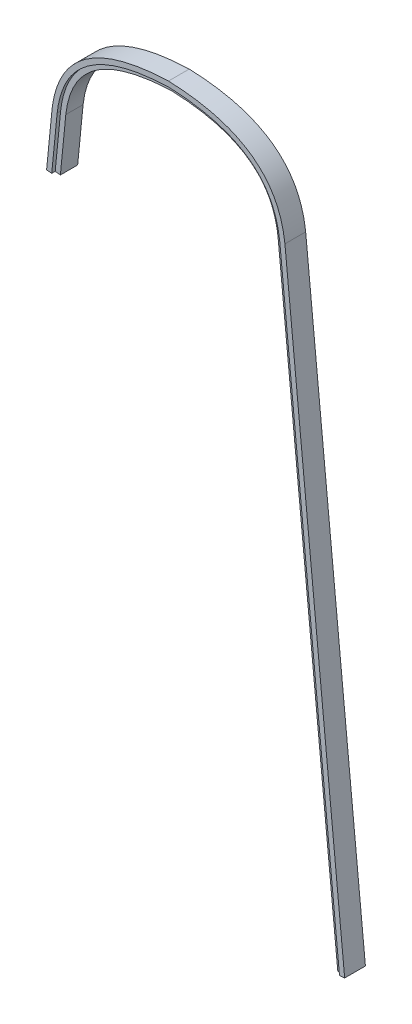
ISO-10303-21;
HEADER;
FILE_DESCRIPTION(('STEP AP214'),'2;1');
FILE_NAME('part.step','',(''),(''),'','','');
FILE_SCHEMA(('AUTOMOTIVE_DESIGN { 1 0 10303 214 1 1 1 1 }'));
ENDSEC;
DATA;
#1=APPLICATION_CONTEXT('core data for automotive mechanical design processes');
#2=APPLICATION_PROTOCOL_DEFINITION('international standard','automotive_design',2000,#1);
#3=PRODUCT_CONTEXT('',#1,'mechanical');
#4=PRODUCT('Part','Part','',(#3));
#5=PRODUCT_RELATED_PRODUCT_CATEGORY('part','',(#4));
#6=PRODUCT_DEFINITION_FORMATION('','',#4);
#7=PRODUCT_DEFINITION_CONTEXT('part definition',#1,'design');
#8=PRODUCT_DEFINITION('design','',#6,#7);
#9=PRODUCT_DEFINITION_SHAPE('','',#8);
#10=(LENGTH_UNIT() NAMED_UNIT(*) SI_UNIT(.MILLI.,.METRE.));
#11=(NAMED_UNIT(*) PLANE_ANGLE_UNIT() SI_UNIT($,.RADIAN.));
#12=(NAMED_UNIT(*) SI_UNIT($,.STERADIAN.) SOLID_ANGLE_UNIT());
#13=UNCERTAINTY_MEASURE_WITH_UNIT(LENGTH_MEASURE(1.E-05),#10,'distance_accuracy_value','');
#14=(GEOMETRIC_REPRESENTATION_CONTEXT(3) GLOBAL_UNCERTAINTY_ASSIGNED_CONTEXT((#13)) GLOBAL_UNIT_ASSIGNED_CONTEXT((#10,
#11,#12)) REPRESENTATION_CONTEXT('',''));
#15=CARTESIAN_POINT('',(0.,0.,0.));
#16=DIRECTION('',(0.,0.,1.));
#17=DIRECTION('',(1.,0.,0.));
#18=AXIS2_PLACEMENT_3D('',#15,#16,#17);
#19=CARTESIAN_POINT('',(-111.860365765845,686.278790089287,19.05));
#20=DIRECTION('',(0.0981158450861748,0.995175000159784,0.));
#21=DIRECTION('',(-0.995175000159784,0.0981158450861748,0.));
#22=AXIS2_PLACEMENT_3D('',#19,#20,#21);
#23=PLANE('',#22);
#24=DIRECTION('',(0.,0.,-1.));
#25=VECTOR('',#24,1.);
#26=CARTESIAN_POINT('',(-107.133483550086,685.812759448297,905.176645887389));
#27=LINE('',#26,#25);
#28=CARTESIAN_POINT('',(-107.133483550086,685.812759448297,19.05));
#29=VERTEX_POINT('',#28);
#30=CARTESIAN_POINT('',(-107.133483550086,685.812759448297,15.875));
#31=VERTEX_POINT('',#30);
#32=EDGE_CURVE('E167',#29,#31,#27,.T.);
#33=ORIENTED_EDGE('',*,*,#32,.F.);
#34=DIRECTION('',(0.995175000159784,-0.0981158450861748,0.));
#35=VECTOR('',#34,1.);
#36=CARTESIAN_POINT('',(-111.860365765845,686.278790089287,19.05));
#37=LINE('',#36,#35);
#38=CARTESIAN_POINT('',(-111.860365765845,686.278790089287,19.05));
#39=VERTEX_POINT('',#38);
#40=EDGE_CURVE('E261',#39,#29,#37,.T.);
#41=ORIENTED_EDGE('',*,*,#40,.F.);
#42=DIRECTION('',(0.,0.,-1.));
#43=VECTOR('',#42,1.);
#44=CARTESIAN_POINT('',(-111.860365765845,686.278790089287,19.05));
#45=LINE('',#44,#43);
#46=CARTESIAN_POINT('',(-111.860365765845,686.278790089287,0.));
#47=VERTEX_POINT('',#46);
#48=EDGE_CURVE('E322',#39,#47,#45,.T.);
#49=ORIENTED_EDGE('',*,*,#48,.T.);
#50=DIRECTION('',(0.995175000159784,-0.0981158450861748,0.));
#51=VECTOR('',#50,1.);
#52=CARTESIAN_POINT('',(-111.860365765845,686.278790089287,0.));
#53=LINE('',#52,#51);
#54=CARTESIAN_POINT('',(-102.381323889323,685.344236664841,0.));
#55=VERTEX_POINT('',#54);
#56=EDGE_CURVE('E277',#47,#55,#53,.T.);
#57=ORIENTED_EDGE('',*,*,#56,.T.);
#58=DIRECTION('',(0.,0.,-1.));
#59=VECTOR('',#58,1.);
#60=CARTESIAN_POINT('',(-102.381323889323,685.344236664841,19.05));
#61=LINE('',#60,#59);
#62=CARTESIAN_POINT('',(-102.381323889323,685.344236664841,15.875));
#63=VERTEX_POINT('',#62);
#64=EDGE_CURVE('E320',#63,#55,#61,.T.);
#65=ORIENTED_EDGE('',*,*,#64,.F.);
#66=DIRECTION('',(0.995175000159784,-0.0981158450861748,0.));
#67=VECTOR('',#66,1.);
#68=CARTESIAN_POINT('',(-111.860365765845,686.278790089287,15.875));
#69=LINE('',#68,#67);
#70=EDGE_CURVE('E49',#31,#63,#69,.T.);
#71=ORIENTED_EDGE('',*,*,#70,.F.);
#72=EDGE_LOOP('',(#33,#41,#49,#57,#65,#71));
#73=FACE_BOUND('',#72,.T.);
#74=ADVANCED_FACE('F33',(#73),#23,.F.);
#75=CARTESIAN_POINT('',(152.224173193232,179.795336583684,19.05));
#76=DIRECTION('',(-0.0981158450864142,0.99517500015976,0.));
#77=DIRECTION('',(-0.99517500015976,-0.0981158450864142,0.));
#78=AXIS2_PLACEMENT_3D('',#75,#76,#77);
#79=PLANE('',#78);
#80=DIRECTION('',(0.,0.,-1.));
#81=VECTOR('',#80,1.);
#82=CARTESIAN_POINT('',(156.976332853995,180.263859367141,905.176645887389));
#83=LINE('',#82,#81);
#84=CARTESIAN_POINT('',(156.976332853995,180.263859367141,19.05));
#85=VERTEX_POINT('',#84);
#86=CARTESIAN_POINT('',(156.976332853995,180.263859367141,15.875));
#87=VERTEX_POINT('',#86);
#88=EDGE_CURVE('E159',#85,#87,#83,.T.);
#89=ORIENTED_EDGE('',*,*,#88,.T.);
#90=DIRECTION('',(0.99517500015976,0.0981158450864142,0.));
#91=VECTOR('',#90,1.);
#92=CARTESIAN_POINT('',(152.224173193232,179.795336583684,15.875));
#93=LINE('',#92,#91);
#94=CARTESIAN_POINT('',(152.224173193232,179.795336583684,15.875));
#95=VERTEX_POINT('',#94);
#96=EDGE_CURVE('E384',#95,#87,#93,.T.);
#97=ORIENTED_EDGE('',*,*,#96,.F.);
#98=DIRECTION('',(0.,0.,-1.));
#99=VECTOR('',#98,1.);
#100=CARTESIAN_POINT('',(152.224173193232,179.795336583684,19.05));
#101=LINE('',#100,#99);
#102=CARTESIAN_POINT('',(152.224173193232,179.795336583684,0.));
#103=VERTEX_POINT('',#102);
#104=EDGE_CURVE('E312',#95,#103,#101,.T.);
#105=ORIENTED_EDGE('',*,*,#104,.T.);
#106=DIRECTION('',(0.99517500015976,0.0981158450864142,0.));
#107=VECTOR('',#106,1.);
#108=CARTESIAN_POINT('',(152.224173193232,179.795336583684,0.));
#109=LINE('',#108,#107);
#110=CARTESIAN_POINT('',(161.703215069754,180.729890008132,0.));
#111=VERTEX_POINT('',#110);
#112=EDGE_CURVE('E302',#103,#111,#109,.T.);
#113=ORIENTED_EDGE('',*,*,#112,.T.);
#114=DIRECTION('',(0.,0.,-1.));
#115=VECTOR('',#114,1.);
#116=CARTESIAN_POINT('',(161.703215069754,180.729890008132,19.05));
#117=LINE('',#116,#115);
#118=CARTESIAN_POINT('',(161.703215069754,180.729890008132,19.05));
#119=VERTEX_POINT('',#118);
#120=EDGE_CURVE('E309',#119,#111,#117,.T.);
#121=ORIENTED_EDGE('',*,*,#120,.F.);
#122=DIRECTION('',(0.99517500015976,0.0981158450864142,0.));
#123=VECTOR('',#122,1.);
#124=CARTESIAN_POINT('',(152.224173193232,179.795336583684,19.05));
#125=LINE('',#124,#123);
#126=EDGE_CURVE('E255',#85,#119,#125,.T.);
#127=ORIENTED_EDGE('',*,*,#126,.F.);
#128=EDGE_LOOP('',(#89,#97,#105,#113,#121,#127));
#129=FACE_BOUND('',#128,.T.);
#130=ADVANCED_FACE('F224',(#129),#79,.F.);
#131=CARTESIAN_POINT('',(76.0468024928911,792.100975721355,19.05));
#132=DIRECTION('',(0.,0.,-1.));
#133=DIRECTION('',(-1.,0.,0.));
#134=AXIS2_PLACEMENT_3D('',#131,#132,#133);
#135=PLANE('',#134);
#136=DIRECTION('',(0.0981158450862154,0.99517500015978,0.));
#137=VECTOR('',#136,1.);
#138=CARTESIAN_POINT('',(-102.152626970838,736.332876180646,19.05));
#139=LINE('',#138,#137);
#140=CARTESIAN_POINT('',(-102.152626970859,736.332876180622,19.05));
#141=VERTEX_POINT('',#140);
#142=EDGE_CURVE('E385',#29,#141,#139,.T.);
#143=ORIENTED_EDGE('',*,*,#142,.T.);
#144=CARTESIAN_POINT('',(2.10980796093267E-09,808.047304319422,19.05));
#145=CARTESIAN_POINT('',(-16.1223221690936,807.479219325401,19.05));
#146=CARTESIAN_POINT('',(-30.2987976291191,805.498551699414,19.05));
#147=CARTESIAN_POINT('',(-48.6193709172104,800.498919802227,19.05));
#148=CARTESIAN_POINT('',(-54.2358300324914,798.495292835486,19.05));
#149=CARTESIAN_POINT('',(-64.4994761364401,793.836180237799,19.05));
#150=CARTESIAN_POINT('',(-69.1465290738747,791.181342383898,19.05));
#151=CARTESIAN_POINT('',(-77.5040816009162,785.234589870984,19.05));
#152=CARTESIAN_POINT('',(-81.2153211256746,781.943258676947,19.05));
#153=CARTESIAN_POINT('',(-87.7489953169181,774.708742888267,19.05));
#154=CARTESIAN_POINT('',(-90.5725371252872,770.764926128253,19.05));
#155=CARTESIAN_POINT('',(-95.36185423474,762.178148206602,19.05));
#156=CARTESIAN_POINT('',(-97.3275552657608,757.533990297598,19.05));
#157=CARTESIAN_POINT('',(-100.395212832108,747.499058108064,19.05));
#158=CARTESIAN_POINT('',(-101.496352880589,742.108028155802,19.05));
#159=CARTESIAN_POINT('',(-102.152626970859,736.332876180622,19.05));
#160=B_SPLINE_CURVE_WITH_KNOTS('',3,(#144,#145,#146,#147,#148,#149,#150,#151,#152,#153,#154,
#155,#156,#157,#158,#159),.UNSPECIFIED.,.F.,.F.,(4,2,2,2,2,2,2,4),(0.,0.25,0.375,0.5,0.625,0.75,
0.875,1.),.UNSPECIFIED.);
#161=CARTESIAN_POINT('',(2.10193356318424E-09,808.047304319427,19.05));
#162=VERTEX_POINT('',#161);
#163=EDGE_CURVE('E147',#141,#162,#160,.F.);
#164=ORIENTED_EDGE('',*,*,#163,.T.);
#165=CARTESIAN_POINT('',(102.152626970824,736.332876180851,19.05));
#166=CARTESIAN_POINT('',(101.496352880563,742.108028155893,19.05));
#167=CARTESIAN_POINT('',(100.395212832143,747.499058108064,19.05));
#168=CARTESIAN_POINT('',(97.3275552658921,757.53399029739,19.05));
#169=CARTESIAN_POINT('',(95.3618542349437,762.178148206308,19.05));
#170=CARTESIAN_POINT('',(90.5725371256659,770.764926127815,19.05));
#171=CARTESIAN_POINT('',(87.7489953173806,774.708742887744,19.05));
#172=CARTESIAN_POINT('',(81.2153211263951,781.943258676337,19.05));
#173=CARTESIAN_POINT('',(77.5040816017928,785.234589870374,19.05));
#174=CARTESIAN_POINT('',(69.1465290751,791.181342383259,19.05));
#175=CARTESIAN_POINT('',(64.4994761378949,793.836180237189,19.05));
#176=CARTESIAN_POINT('',(54.2358300343883,798.495292834908,19.05));
#177=CARTESIAN_POINT('',(48.6193709193301,800.498919801625,19.05));
#178=CARTESIAN_POINT('',(30.2987976320406,805.49855169896,19.05));
#179=CARTESIAN_POINT('',(16.1223221725936,807.479219325171,19.05));
#180=CARTESIAN_POINT('',(2.10193356318424E-09,808.047304319427,19.05));
#181=B_SPLINE_CURVE_WITH_KNOTS('',3,(#165,#166,#167,#168,#169,#170,#171,#172,#173,#174,#175,
#176,#177,#178,#179,#180),.UNSPECIFIED.,.F.,.F.,(4,2,2,2,2,2,2,4),(0.,0.125,0.25,0.375,0.5,
0.625,0.75,1.),.UNSPECIFIED.);
#182=CARTESIAN_POINT('',(102.152626970806,736.332876180879,19.0500000000002));
#183=VERTEX_POINT('',#182);
#184=EDGE_CURVE('E141',#162,#183,#181,.F.);
#185=ORIENTED_EDGE('',*,*,#184,.T.);
#186=DIRECTION('',(0.0981158450864326,-0.995175000159759,0.));
#187=VECTOR('',#186,1.);
#188=CARTESIAN_POINT('',(156.976332853995,180.263859367141,19.05));
#189=LINE('',#188,#187);
#190=EDGE_CURVE('E144',#183,#85,#189,.T.);
#191=ORIENTED_EDGE('',*,*,#190,.T.);
#192=ORIENTED_EDGE('',*,*,#126,.T.);
#193=DIRECTION('',(-0.0981158450864121,0.99517500015976,0.));
#194=VECTOR('',#193,1.);
#195=CARTESIAN_POINT('',(161.703215069754,180.729890008132,19.05));
#196=LINE('',#195,#194);
#197=CARTESIAN_POINT('',(106.876080835467,736.833680097404,19.05));
#198=VERTEX_POINT('',#197);
#199=EDGE_CURVE('E260',#119,#198,#196,.T.);
#200=ORIENTED_EDGE('',*,*,#199,.T.);
#201=CARTESIAN_POINT('',(106.876080835467,736.833680097404,19.05));
#202=CARTESIAN_POINT('',(98.6555645680486,809.385111394009,19.05));
#203=CARTESIAN_POINT('',(0.,812.8,19.05));
#204=B_SPLINE_CURVE_WITH_KNOTS('',2,(#201,#202,#203),.UNSPECIFIED.,.F.,.F.,(3,3),(0.,1.),.UNSPECIFIED.);
#205=CARTESIAN_POINT('',(0.,812.8,19.05));
#206=VERTEX_POINT('',#205);
#207=EDGE_CURVE('E306',#198,#206,#204,.T.);
#208=ORIENTED_EDGE('',*,*,#207,.T.);
#209=CARTESIAN_POINT('',(0.,812.8,19.05));
#210=CARTESIAN_POINT('',(-98.6555645680486,809.385111394009,19.05));
#211=CARTESIAN_POINT('',(-106.876080835467,736.833680097404,19.05));
#212=B_SPLINE_CURVE_WITH_KNOTS('',2,(#209,#210,#211),.UNSPECIFIED.,.F.,.F.,(3,3),(0.,1.),.UNSPECIFIED.);
#213=CARTESIAN_POINT('',(-106.876080835467,736.833680097404,19.05));
#214=VERTEX_POINT('',#213);
#215=EDGE_CURVE('E339',#206,#214,#212,.T.);
#216=ORIENTED_EDGE('',*,*,#215,.T.);
#217=DIRECTION('',(-0.0981158450861761,-0.995175000159784,0.));
#218=VECTOR('',#217,1.);
#219=CARTESIAN_POINT('',(-111.860365765845,686.278790089287,19.05));
#220=LINE('',#219,#218);
#221=EDGE_CURVE('E331',#214,#39,#220,.T.);
#222=ORIENTED_EDGE('',*,*,#221,.T.);
#223=ORIENTED_EDGE('',*,*,#40,.T.);
#224=EDGE_LOOP('',(#143,#164,#185,#191,#192,#200,#208,#216,#222,#223));
#225=FACE_BOUND('',#224,.T.);
#226=ADVANCED_FACE('F143',(#225),#135,.F.);
#227=DIRECTION('',(0.,0.,-1.));
#228=VECTOR('',#227,1.);
#229=SURFACE_OF_LINEAR_EXTRUSION('',#204,#228);
#230=CARTESIAN_POINT('',(106.876080835467,736.833680097404,0.));
#231=CARTESIAN_POINT('',(98.6555645680486,809.385111394009,0.));
#232=CARTESIAN_POINT('',(0.,812.8,0.));
#233=B_SPLINE_CURVE_WITH_KNOTS('',2,(#230,#231,#232),.UNSPECIFIED.,.F.,.F.,(3,3),(0.,1.),.UNSPECIFIED.);
#234=CARTESIAN_POINT('',(106.876080835467,736.833680097404,0.));
#235=VERTEX_POINT('',#234);
#236=CARTESIAN_POINT('',(0.,812.8,0.));
#237=VERTEX_POINT('',#236);
#238=EDGE_CURVE('E189',#235,#237,#233,.T.);
#239=ORIENTED_EDGE('',*,*,#238,.T.);
#240=DIRECTION('',(0.,0.,-1.));
#241=VECTOR('',#240,1.);
#242=CARTESIAN_POINT('',(0.,812.8,19.05));
#243=LINE('',#242,#241);
#244=EDGE_CURVE('E11',#206,#237,#243,.T.);
#245=ORIENTED_EDGE('',*,*,#244,.F.);
#246=ORIENTED_EDGE('',*,*,#207,.F.);
#247=DIRECTION('',(0.,0.,-1.));
#248=VECTOR('',#247,1.);
#249=CARTESIAN_POINT('',(106.876080835467,736.833680097404,19.05));
#250=LINE('',#249,#248);
#251=EDGE_CURVE('E262',#198,#235,#250,.T.);
#252=ORIENTED_EDGE('',*,*,#251,.T.);
#253=EDGE_LOOP('',(#239,#245,#246,#252));
#254=FACE_BOUND('',#253,.T.);
#255=ADVANCED_FACE('F35',(#254),#229,.F.);
#256=DIRECTION('',(0.,0.,-1.));
#257=VECTOR('',#256,1.);
#258=SURFACE_OF_LINEAR_EXTRUSION('',#212,#257);
#259=CARTESIAN_POINT('',(0.,812.8,0.));
#260=CARTESIAN_POINT('',(-98.6555645680486,809.385111394009,0.));
#261=CARTESIAN_POINT('',(-106.876080835467,736.833680097404,0.));
#262=B_SPLINE_CURVE_WITH_KNOTS('',2,(#259,#260,#261),.UNSPECIFIED.,.F.,.F.,(3,3),(0.,1.),.UNSPECIFIED.);
#263=CARTESIAN_POINT('',(-106.876080835467,736.833680097404,0.));
#264=VERTEX_POINT('',#263);
#265=EDGE_CURVE('E194',#237,#264,#262,.T.);
#266=ORIENTED_EDGE('',*,*,#265,.T.);
#267=DIRECTION('',(0.,0.,-1.));
#268=VECTOR('',#267,1.);
#269=CARTESIAN_POINT('',(-106.876080835467,736.833680097404,19.05));
#270=LINE('',#269,#268);
#271=EDGE_CURVE('E42',#214,#264,#270,.T.);
#272=ORIENTED_EDGE('',*,*,#271,.F.);
#273=ORIENTED_EDGE('',*,*,#215,.F.);
#274=ORIENTED_EDGE('',*,*,#244,.T.);
#275=EDGE_LOOP('',(#266,#272,#273,#274));
#276=FACE_BOUND('',#275,.T.);
#277=ADVANCED_FACE('F352',(#276),#258,.F.);
#278=CARTESIAN_POINT('',(-111.860365765845,686.278790089287,19.05));
#279=DIRECTION('',(0.995175000159784,-0.0981158450861761,0.));
#280=DIRECTION('',(0.0981158450861761,0.995175000159784,0.));
#281=AXIS2_PLACEMENT_3D('',#278,#279,#280);
#282=PLANE('',#281);
#283=DIRECTION('',(-0.0981158450861761,-0.995175000159784,0.));
#284=VECTOR('',#283,1.);
#285=CARTESIAN_POINT('',(-111.860365765845,686.278790089287,0.));
#286=LINE('',#285,#284);
#287=EDGE_CURVE('E272',#264,#47,#286,.T.);
#288=ORIENTED_EDGE('',*,*,#287,.T.);
#289=ORIENTED_EDGE('',*,*,#48,.F.);
#290=ORIENTED_EDGE('',*,*,#221,.F.);
#291=ORIENTED_EDGE('',*,*,#271,.T.);
#292=EDGE_LOOP('',(#288,#289,#290,#291));
#293=FACE_BOUND('',#292,.T.);
#294=ADVANCED_FACE('F329',(#293),#282,.F.);
#295=CARTESIAN_POINT('',(-102.381323889323,685.344236664841,19.05));
#296=DIRECTION('',(-0.995175000159784,0.0981158450861753,0.));
#297=DIRECTION('',(-0.0981158450861753,-0.995175000159784,0.));
#298=AXIS2_PLACEMENT_3D('',#295,#296,#297);
#299=PLANE('',#298);
#300=DIRECTION('',(0.,0.,-1.));
#301=VECTOR('',#300,1.);
#302=CARTESIAN_POINT('',(-97.4039935722563,735.828587023661,19.05));
#303=LINE('',#302,#301);
#304=CARTESIAN_POINT('',(-97.4039935722563,735.828587023661,15.875));
#305=VERTEX_POINT('',#304);
#306=CARTESIAN_POINT('',(-97.4039935722563,735.828587023661,0.));
#307=VERTEX_POINT('',#306);
#308=EDGE_CURVE('E318',#305,#307,#303,.T.);
#309=ORIENTED_EDGE('',*,*,#308,.F.);
#310=DIRECTION('',(0.0981158450861753,0.995175000159784,0.));
#311=VECTOR('',#310,1.);
#312=CARTESIAN_POINT('',(-102.381323889323,685.344236664841,15.875));
#313=LINE('',#312,#311);
#314=EDGE_CURVE('E57',#63,#305,#313,.T.);
#315=ORIENTED_EDGE('',*,*,#314,.F.);
#316=ORIENTED_EDGE('',*,*,#64,.T.);
#317=DIRECTION('',(0.0981158450861753,0.995175000159784,0.));
#318=VECTOR('',#317,1.);
#319=CARTESIAN_POINT('',(-102.381323889323,685.344236664841,0.));
#320=LINE('',#319,#318);
#321=EDGE_CURVE('E280',#55,#307,#320,.T.);
#322=ORIENTED_EDGE('',*,*,#321,.T.);
#323=EDGE_LOOP('',(#309,#315,#316,#322));
#324=FACE_BOUND('',#323,.T.);
#325=ADVANCED_FACE('F357',(#324),#299,.F.);
#326=CARTESIAN_POINT('',(-97.4039935722563,735.828587023661,19.05));
#327=CARTESIAN_POINT('',(-97.326205951253,736.510966359989,19.05));
#328=CARTESIAN_POINT('',(-97.155379667203,737.881968464563,19.05));
#329=CARTESIAN_POINT('',(-96.7640206157551,740.553537606214,19.05));
#330=CARTESIAN_POINT('',(-96.1773627381843,743.805316844232,19.05));
#331=CARTESIAN_POINT('',(-95.3214140006335,747.554999290884,19.05));
#332=CARTESIAN_POINT('',(-93.979934001174,752.35928640652,19.05));
#333=CARTESIAN_POINT('',(-91.9331304846639,758.003164249531,19.05));
#334=CARTESIAN_POINT('',(-88.8952522600488,764.228265264045,19.05));
#335=CARTESIAN_POINT('',(-85.2743135617032,769.94319981308,19.05));
#336=CARTESIAN_POINT('',(-79.6482414168445,776.932392043285,19.05));
#337=CARTESIAN_POINT('',(-71.0507907120023,784.572420077555,19.05));
#338=CARTESIAN_POINT('',(-60.1294569627952,790.832450745801,19.05));
#339=CARTESIAN_POINT('',(-49.8978420395021,794.967332344282,19.05));
#340=CARTESIAN_POINT('',(-41.4669949701455,797.61410959326,19.05));
#341=CARTESIAN_POINT('',(-32.2731280075788,799.790052384111,19.05));
#342=CARTESIAN_POINT('',(-23.9757920629625,801.198424890801,19.05));
#343=CARTESIAN_POINT('',(-16.9573043317651,802.075979485788,19.05));
#344=CARTESIAN_POINT('',(-11.5049121120337,802.608232021653,19.05));
#345=CARTESIAN_POINT('',(-6.80036284859541,802.946009067599,19.05));
#346=CARTESIAN_POINT('',(-2.95007512349241,803.15190905775,19.05));
#347=CARTESIAN_POINT('',(-0.979817657945961,803.233925105122,19.05));
#348=CARTESIAN_POINT('',(4.83499958819911E-13,803.269086279872,19.05));
#349=B_SPLINE_CURVE_WITH_KNOTS('',3,(#326,#327,#328,#329,#330,#331,#332,#333,#334,#335,#336,
#337,#338,#339,#340,#341,#342,#343,#344,#345,#346,#347,#348),.UNSPECIFIED.,.F.,.F.,(4,1,1,1,1,1,
1,1,1,1,1,1,1,1,1,1,1,1,1,1,4),(0.000508173003004952,0.0160981610015977,0.0316881490001905,
0.062868124997376,0.0940481009945616,0.125228076991747,0.187588028986118,0.249947980980489,
0.31230793297486,0.374667884969231,0.499387788957974,0.624107692946716,0.686467644941087,
0.748827596935458,0.811187548929829,0.8735475009242,0.904727476921386,0.935907452918571,
0.967087428915757,0.98267741691435,0.998267404912942),.UNSPECIFIED.);
#350=DIRECTION('',(0.,0.,-1.));
#351=VECTOR('',#350,1.);
#352=SURFACE_OF_LINEAR_EXTRUSION('',#349,#351);
#353=DIRECTION('',(0.,0.,-1.));
#354=VECTOR('',#353,1.);
#355=CARTESIAN_POINT('',(4.83499958819911E-13,803.269086279872,19.05));
#356=LINE('',#355,#354);
#357=CARTESIAN_POINT('',(4.83499958819911E-13,803.269086279872,15.875));
#358=VERTEX_POINT('',#357);
#359=CARTESIAN_POINT('',(4.83499958819911E-13,803.269086279872,0.));
#360=VERTEX_POINT('',#359);
#361=EDGE_CURVE('E316',#358,#360,#356,.T.);
#362=ORIENTED_EDGE('',*,*,#361,.F.);
#363=CARTESIAN_POINT('',(-97.4039935722563,735.828587023661,15.875));
#364=CARTESIAN_POINT('',(-97.326205951253,736.510966359989,15.875));
#365=CARTESIAN_POINT('',(-97.155379667203,737.881968464563,15.875));
#366=CARTESIAN_POINT('',(-96.7640206157551,740.553537606214,15.875));
#367=CARTESIAN_POINT('',(-96.1773627381843,743.805316844232,15.875));
#368=CARTESIAN_POINT('',(-95.3214140006335,747.554999290884,15.875));
#369=CARTESIAN_POINT('',(-93.979934001174,752.35928640652,15.875));
#370=CARTESIAN_POINT('',(-91.9331304846639,758.003164249531,15.875));
#371=CARTESIAN_POINT('',(-88.8952522600488,764.228265264045,15.875));
#372=CARTESIAN_POINT('',(-85.2743135617032,769.94319981308,15.875));
#373=CARTESIAN_POINT('',(-79.6482414168445,776.932392043285,15.875));
#374=CARTESIAN_POINT('',(-71.0507907120023,784.572420077555,15.875));
#375=CARTESIAN_POINT('',(-60.1294569627952,790.832450745801,15.875));
#376=CARTESIAN_POINT('',(-49.8978420395021,794.967332344282,15.875));
#377=CARTESIAN_POINT('',(-41.4669949701455,797.61410959326,15.875));
#378=CARTESIAN_POINT('',(-32.2731280075788,799.790052384111,15.875));
#379=CARTESIAN_POINT('',(-23.9757920629625,801.198424890801,15.875));
#380=CARTESIAN_POINT('',(-16.9573043317651,802.075979485788,15.875));
#381=CARTESIAN_POINT('',(-11.5049121120337,802.608232021653,15.875));
#382=CARTESIAN_POINT('',(-6.80036284859541,802.946009067599,15.875));
#383=CARTESIAN_POINT('',(-2.95007512349241,803.15190905775,15.875));
#384=CARTESIAN_POINT('',(-0.979817657945961,803.233925105122,15.875));
#385=CARTESIAN_POINT('',(4.83499958819911E-13,803.269086279872,15.875));
#386=B_SPLINE_CURVE_WITH_KNOTS('',3,(#363,#364,#365,#366,#367,#368,#369,#370,#371,#372,#373,
#374,#375,#376,#377,#378,#379,#380,#381,#382,#383,#384,#385),.UNSPECIFIED.,.F.,.F.,(4,1,1,1,1,1,
1,1,1,1,1,1,1,1,1,1,1,1,1,1,4),(0.000508173003004952,0.0160981610015977,0.0316881490001905,
0.062868124997376,0.0940481009945616,0.125228076991747,0.187588028986118,0.249947980980489,
0.31230793297486,0.374667884969231,0.499387788957974,0.624107692946716,0.686467644941087,
0.748827596935458,0.811187548929829,0.8735475009242,0.904727476921386,0.935907452918571,
0.967087428915757,0.98267741691435,0.998267404912942),.UNSPECIFIED.);
#387=EDGE_CURVE('E367',#305,#358,#386,.T.);
#388=ORIENTED_EDGE('',*,*,#387,.F.);
#389=ORIENTED_EDGE('',*,*,#308,.T.);
#390=CARTESIAN_POINT('',(-97.4039935722563,735.828587023661,0.));
#391=CARTESIAN_POINT('',(-97.326205951253,736.510966359989,0.));
#392=CARTESIAN_POINT('',(-97.155379667203,737.881968464563,0.));
#393=CARTESIAN_POINT('',(-96.7640206157551,740.553537606214,0.));
#394=CARTESIAN_POINT('',(-96.1773627381843,743.805316844232,0.));
#395=CARTESIAN_POINT('',(-95.3214140006335,747.554999290884,0.));
#396=CARTESIAN_POINT('',(-93.979934001174,752.35928640652,0.));
#397=CARTESIAN_POINT('',(-91.9331304846639,758.003164249531,0.));
#398=CARTESIAN_POINT('',(-88.8952522600488,764.228265264045,0.));
#399=CARTESIAN_POINT('',(-85.2743135617032,769.94319981308,0.));
#400=CARTESIAN_POINT('',(-79.6482414168445,776.932392043285,0.));
#401=CARTESIAN_POINT('',(-71.0507907120023,784.572420077555,0.));
#402=CARTESIAN_POINT('',(-60.1294569627952,790.832450745801,0.));
#403=CARTESIAN_POINT('',(-49.8978420395021,794.967332344282,0.));
#404=CARTESIAN_POINT('',(-41.4669949701455,797.61410959326,0.));
#405=CARTESIAN_POINT('',(-32.2731280075788,799.790052384111,0.));
#406=CARTESIAN_POINT('',(-23.9757920629625,801.198424890801,0.));
#407=CARTESIAN_POINT('',(-16.9573043317651,802.075979485788,0.));
#408=CARTESIAN_POINT('',(-11.5049121120337,802.608232021653,0.));
#409=CARTESIAN_POINT('',(-6.80036284859541,802.946009067599,0.));
#410=CARTESIAN_POINT('',(-2.95007512349241,803.15190905775,0.));
#411=CARTESIAN_POINT('',(-0.979817657945961,803.233925105122,0.));
#412=CARTESIAN_POINT('',(4.83499958819911E-13,803.269086279872,0.));
#413=B_SPLINE_CURVE_WITH_KNOTS('',3,(#390,#391,#392,#393,#394,#395,#396,#397,#398,#399,#400,
#401,#402,#403,#404,#405,#406,#407,#408,#409,#410,#411,#412),.UNSPECIFIED.,.F.,.F.,(4,1,1,1,1,1,
1,1,1,1,1,1,1,1,1,1,1,1,1,1,4),(0.000508173003004952,0.0160981610015977,0.0316881490001905,
0.062868124997376,0.0940481009945616,0.125228076991747,0.187588028986118,0.249947980980489,
0.31230793297486,0.374667884969231,0.499387788957974,0.624107692946716,0.686467644941087,
0.748827596935458,0.811187548929829,0.8735475009242,0.904727476921386,0.935907452918571,
0.967087428915757,0.98267741691435,0.998267404912942),.UNSPECIFIED.);
#414=EDGE_CURVE('E283',#307,#360,#413,.T.);
#415=ORIENTED_EDGE('',*,*,#414,.T.);
#416=EDGE_LOOP('',(#362,#388,#389,#415));
#417=FACE_BOUND('',#416,.T.);
#418=ADVANCED_FACE('F243',(#417),#352,.F.);
#419=CARTESIAN_POINT('',(-4.7309161796405E-13,803.269086279872,19.05));
#420=CARTESIAN_POINT('',(0.979817657945981,803.233925105122,19.05));
#421=CARTESIAN_POINT('',(2.95007512349245,803.151909057751,19.05));
#422=CARTESIAN_POINT('',(6.80036284859554,802.946009067598,19.05));
#423=CARTESIAN_POINT('',(11.5049121120339,802.608232021652,19.05));
#424=CARTESIAN_POINT('',(16.9573043317653,802.075979485789,19.05));
#425=CARTESIAN_POINT('',(23.9757920629628,801.1984248908,19.05));
#426=CARTESIAN_POINT('',(32.2731280075792,799.79005238411,19.05));
#427=CARTESIAN_POINT('',(41.466994970146,797.61410959326,19.05));
#428=CARTESIAN_POINT('',(49.8978420395027,794.967332344282,19.05));
#429=CARTESIAN_POINT('',(60.1294569627958,790.8324507458,19.05));
#430=CARTESIAN_POINT('',(71.0507907120028,784.572420077556,19.05));
#431=CARTESIAN_POINT('',(79.6482414168451,776.932392043284,19.05));
#432=CARTESIAN_POINT('',(85.2743135617038,769.943199813079,19.05));
#433=CARTESIAN_POINT('',(88.8952522600493,764.228265264044,19.05));
#434=CARTESIAN_POINT('',(91.9331304846643,758.00316424953,19.05));
#435=CARTESIAN_POINT('',(93.9799340011744,752.359286406519,19.05));
#436=CARTESIAN_POINT('',(95.3214140006338,747.554999290883,19.05));
#437=CARTESIAN_POINT('',(96.1773627381847,743.805316844231,19.05));
#438=CARTESIAN_POINT('',(96.7640206157553,740.553537606213,19.05));
#439=CARTESIAN_POINT('',(97.1553796672032,737.881968464562,19.05));
#440=CARTESIAN_POINT('',(97.3262059512532,736.510966359987,19.05));
#441=CARTESIAN_POINT('',(97.4039935722564,735.82858702366,19.05));
#442=B_SPLINE_CURVE_WITH_KNOTS('',3,(#419,#420,#421,#422,#423,#424,#425,#426,#427,#428,#429,
#430,#431,#432,#433,#434,#435,#436,#437,#438,#439,#440,#441),.UNSPECIFIED.,.F.,.F.,(4,1,1,1,1,1,
1,1,1,1,1,1,1,1,1,1,1,1,1,1,4),(0.000508173002992107,0.016098161001585,0.031688149000178,
0.062868124997364,0.09404810099455,0.125228076991736,0.187588028986108,0.24994798098048,
0.312307932974852,0.374667884969223,0.499387788957967,0.624107692946711,0.686467644941083,
0.748827596935455,0.811187548929827,0.873547500924198,0.904727476921384,0.93590745291857,
0.967087428915756,0.982677416914349,0.998267404912942),.UNSPECIFIED.);
#443=DIRECTION('',(0.,0.,-1.));
#444=VECTOR('',#443,1.);
#445=SURFACE_OF_LINEAR_EXTRUSION('',#442,#444);
#446=DIRECTION('',(0.,0.,-1.));
#447=VECTOR('',#446,1.);
#448=CARTESIAN_POINT('',(97.4039935722564,735.82858702366,19.05));
#449=LINE('',#448,#447);
#450=CARTESIAN_POINT('',(97.4039935722564,735.82858702366,15.875));
#451=VERTEX_POINT('',#450);
#452=CARTESIAN_POINT('',(97.4039935722564,735.82858702366,0.));
#453=VERTEX_POINT('',#452);
#454=EDGE_CURVE('E314',#451,#453,#449,.T.);
#455=ORIENTED_EDGE('',*,*,#454,.F.);
#456=CARTESIAN_POINT('',(-4.7309161796405E-13,803.269086279872,15.875));
#457=CARTESIAN_POINT('',(0.979817657945981,803.233925105122,15.875));
#458=CARTESIAN_POINT('',(2.95007512349245,803.151909057751,15.875));
#459=CARTESIAN_POINT('',(6.80036284859554,802.946009067598,15.875));
#460=CARTESIAN_POINT('',(11.5049121120339,802.608232021652,15.875));
#461=CARTESIAN_POINT('',(16.9573043317653,802.075979485789,15.875));
#462=CARTESIAN_POINT('',(23.9757920629628,801.1984248908,15.875));
#463=CARTESIAN_POINT('',(32.2731280075792,799.79005238411,15.875));
#464=CARTESIAN_POINT('',(41.466994970146,797.61410959326,15.875));
#465=CARTESIAN_POINT('',(49.8978420395027,794.967332344282,15.875));
#466=CARTESIAN_POINT('',(60.1294569627958,790.8324507458,15.875));
#467=CARTESIAN_POINT('',(71.0507907120028,784.572420077556,15.875));
#468=CARTESIAN_POINT('',(79.6482414168451,776.932392043284,15.875));
#469=CARTESIAN_POINT('',(85.2743135617038,769.943199813079,15.875));
#470=CARTESIAN_POINT('',(88.8952522600493,764.228265264044,15.875));
#471=CARTESIAN_POINT('',(91.9331304846643,758.00316424953,15.875));
#472=CARTESIAN_POINT('',(93.9799340011744,752.359286406519,15.875));
#473=CARTESIAN_POINT('',(95.3214140006338,747.554999290883,15.875));
#474=CARTESIAN_POINT('',(96.1773627381847,743.805316844231,15.875));
#475=CARTESIAN_POINT('',(96.7640206157553,740.553537606213,15.875));
#476=CARTESIAN_POINT('',(97.1553796672032,737.881968464562,15.875));
#477=CARTESIAN_POINT('',(97.3262059512532,736.510966359987,15.875));
#478=CARTESIAN_POINT('',(97.4039935722564,735.82858702366,15.875));
#479=B_SPLINE_CURVE_WITH_KNOTS('',3,(#456,#457,#458,#459,#460,#461,#462,#463,#464,#465,#466,
#467,#468,#469,#470,#471,#472,#473,#474,#475,#476,#477,#478),.UNSPECIFIED.,.F.,.F.,(4,1,1,1,1,1,
1,1,1,1,1,1,1,1,1,1,1,1,1,1,4),(0.000508173002992107,0.016098161001585,0.031688149000178,
0.062868124997364,0.09404810099455,0.125228076991736,0.187588028986108,0.24994798098048,
0.312307932974852,0.374667884969223,0.499387788957967,0.624107692946711,0.686467644941083,
0.748827596935455,0.811187548929827,0.873547500924198,0.904727476921384,0.93590745291857,
0.967087428915756,0.982677416914349,0.998267404912942),.UNSPECIFIED.);
#480=EDGE_CURVE('E368',#358,#451,#479,.T.);
#481=ORIENTED_EDGE('',*,*,#480,.F.);
#482=ORIENTED_EDGE('',*,*,#361,.T.);
#483=CARTESIAN_POINT('',(-4.7309161796405E-13,803.269086279872,0.));
#484=CARTESIAN_POINT('',(0.979817657945981,803.233925105122,0.));
#485=CARTESIAN_POINT('',(2.95007512349245,803.151909057751,0.));
#486=CARTESIAN_POINT('',(6.80036284859554,802.946009067598,0.));
#487=CARTESIAN_POINT('',(11.5049121120339,802.608232021652,0.));
#488=CARTESIAN_POINT('',(16.9573043317653,802.075979485789,0.));
#489=CARTESIAN_POINT('',(23.9757920629628,801.1984248908,0.));
#490=CARTESIAN_POINT('',(32.2731280075792,799.79005238411,0.));
#491=CARTESIAN_POINT('',(41.466994970146,797.61410959326,0.));
#492=CARTESIAN_POINT('',(49.8978420395027,794.967332344282,0.));
#493=CARTESIAN_POINT('',(60.1294569627958,790.8324507458,0.));
#494=CARTESIAN_POINT('',(71.0507907120028,784.572420077556,0.));
#495=CARTESIAN_POINT('',(79.6482414168451,776.932392043284,0.));
#496=CARTESIAN_POINT('',(85.2743135617038,769.943199813079,0.));
#497=CARTESIAN_POINT('',(88.8952522600493,764.228265264044,0.));
#498=CARTESIAN_POINT('',(91.9331304846643,758.00316424953,0.));
#499=CARTESIAN_POINT('',(93.9799340011744,752.359286406519,0.));
#500=CARTESIAN_POINT('',(95.3214140006338,747.554999290883,0.));
#501=CARTESIAN_POINT('',(96.1773627381847,743.805316844231,0.));
#502=CARTESIAN_POINT('',(96.7640206157553,740.553537606213,0.));
#503=CARTESIAN_POINT('',(97.1553796672032,737.881968464562,0.));
#504=CARTESIAN_POINT('',(97.3262059512532,736.510966359987,0.));
#505=CARTESIAN_POINT('',(97.4039935722564,735.82858702366,0.));
#506=B_SPLINE_CURVE_WITH_KNOTS('',3,(#483,#484,#485,#486,#487,#488,#489,#490,#491,#492,#493,
#494,#495,#496,#497,#498,#499,#500,#501,#502,#503,#504,#505),.UNSPECIFIED.,.F.,.F.,(4,1,1,1,1,1,
1,1,1,1,1,1,1,1,1,1,1,1,1,1,4),(0.000508173002992107,0.016098161001585,0.031688149000178,
0.062868124997364,0.09404810099455,0.125228076991736,0.187588028986108,0.24994798098048,
0.312307932974852,0.374667884969223,0.499387788957967,0.624107692946711,0.686467644941083,
0.748827596935455,0.811187548929827,0.873547500924198,0.904727476921384,0.93590745291857,
0.967087428915756,0.982677416914349,0.998267404912942),.UNSPECIFIED.);
#507=EDGE_CURVE('E288',#360,#453,#506,.T.);
#508=ORIENTED_EDGE('',*,*,#507,.T.);
#509=EDGE_LOOP('',(#455,#481,#482,#508));
#510=FACE_BOUND('',#509,.T.);
#511=ADVANCED_FACE('F238',(#510),#445,.F.);
#512=CARTESIAN_POINT('',(152.224173193232,179.795336583684,19.05));
#513=DIRECTION('',(0.99517500015976,0.0981158450864121,0.));
#514=DIRECTION('',(-0.0981158450864121,0.995175000159761,0.));
#515=AXIS2_PLACEMENT_3D('',#512,#513,#514);
#516=PLANE('',#515);
#517=ORIENTED_EDGE('',*,*,#104,.F.);
#518=DIRECTION('',(0.0981158450864121,-0.99517500015976,0.));
#519=VECTOR('',#518,1.);
#520=CARTESIAN_POINT('',(152.224173193232,179.795336583684,15.875));
#521=LINE('',#520,#519);
#522=EDGE_CURVE('E379',#451,#95,#521,.T.);
#523=ORIENTED_EDGE('',*,*,#522,.F.);
#524=ORIENTED_EDGE('',*,*,#454,.T.);
#525=DIRECTION('',(0.0981158450864121,-0.99517500015976,0.));
#526=VECTOR('',#525,1.);
#527=CARTESIAN_POINT('',(152.224173193232,179.795336583684,0.));
#528=LINE('',#527,#526);
#529=EDGE_CURVE('E296',#453,#103,#528,.T.);
#530=ORIENTED_EDGE('',*,*,#529,.T.);
#531=EDGE_LOOP('',(#517,#523,#524,#530));
#532=FACE_BOUND('',#531,.T.);
#533=ADVANCED_FACE('F231',(#532),#516,.F.);
#534=CARTESIAN_POINT('',(161.703215069754,180.729890008132,19.05));
#535=DIRECTION('',(-0.99517500015976,-0.0981158450864121,0.));
#536=DIRECTION('',(0.0981158450864121,-0.995175000159761,0.));
#537=AXIS2_PLACEMENT_3D('',#534,#535,#536);
#538=PLANE('',#537);
#539=DIRECTION('',(-0.0981158450864121,0.99517500015976,0.));
#540=VECTOR('',#539,1.);
#541=CARTESIAN_POINT('',(161.703215069754,180.729890008132,0.));
#542=LINE('',#541,#540);
#543=EDGE_CURVE('E304',#111,#235,#542,.T.);
#544=ORIENTED_EDGE('',*,*,#543,.T.);
#545=ORIENTED_EDGE('',*,*,#251,.F.);
#546=ORIENTED_EDGE('',*,*,#199,.F.);
#547=ORIENTED_EDGE('',*,*,#120,.T.);
#548=EDGE_LOOP('',(#544,#545,#546,#547));
#549=FACE_BOUND('',#548,.T.);
#550=ADVANCED_FACE('F227',(#549),#538,.F.);
#551=CARTESIAN_POINT('',(76.0468024928911,792.100975721355,0.));
#552=DIRECTION('',(0.,0.,-1.));
#553=DIRECTION('',(-1.,0.,0.));
#554=AXIS2_PLACEMENT_3D('',#551,#552,#553);
#555=PLANE('',#554);
#556=ORIENTED_EDGE('',*,*,#238,.F.);
#557=ORIENTED_EDGE('',*,*,#543,.F.);
#558=ORIENTED_EDGE('',*,*,#112,.F.);
#559=ORIENTED_EDGE('',*,*,#529,.F.);
#560=ORIENTED_EDGE('',*,*,#507,.F.);
#561=ORIENTED_EDGE('',*,*,#414,.F.);
#562=ORIENTED_EDGE('',*,*,#321,.F.);
#563=ORIENTED_EDGE('',*,*,#56,.F.);
#564=ORIENTED_EDGE('',*,*,#287,.F.);
#565=ORIENTED_EDGE('',*,*,#265,.F.);
#566=EDGE_LOOP('',(#556,#557,#558,#559,#560,#561,#562,#563,#564,#565));
#567=FACE_BOUND('',#566,.T.);
#568=ADVANCED_FACE('F217',(#567),#555,.T.);
#569=CARTESIAN_POINT('',(-102.152626970838,736.332876180646,905.176645887389));
#570=DIRECTION('',(0.99517500015978,-0.0981158450862154,0.));
#571=DIRECTION('',(0.0981158450862154,0.99517500015978,0.));
#572=AXIS2_PLACEMENT_3D('',#569,#570,#571);
#573=PLANE('',#572);
#574=ORIENTED_EDGE('',*,*,#142,.F.);
#575=ORIENTED_EDGE('',*,*,#32,.T.);
#576=DIRECTION('',(0.0981158450862154,0.99517500015978,0.));
#577=VECTOR('',#576,1.);
#578=CARTESIAN_POINT('',(-102.152626970838,736.332876180646,15.875));
#579=LINE('',#578,#577);
#580=CARTESIAN_POINT('',(-102.15262697085,736.332876180621,15.8749999999999));
#581=VERTEX_POINT('',#580);
#582=EDGE_CURVE('E169',#31,#581,#579,.T.);
#583=ORIENTED_EDGE('',*,*,#582,.T.);
#584=DIRECTION('',(0.,0.,-1.));
#585=VECTOR('',#584,1.);
#586=CARTESIAN_POINT('',(-102.152626970859,736.332876180622,905.176645887389));
#587=LINE('',#586,#585);
#588=EDGE_CURVE('E187',#141,#581,#587,.T.);
#589=ORIENTED_EDGE('',*,*,#588,.F.);
#590=EDGE_LOOP('',(#574,#575,#583,#589));
#591=FACE_BOUND('',#590,.T.);
#592=ADVANCED_FACE('F214',(#591),#573,.T.);
#593=CARTESIAN_POINT('',(2.10980796093267E-09,808.047304319422,905.176645887389));
#594=CARTESIAN_POINT('',(-16.1223221690936,807.479219325401,905.176645887389));
#595=CARTESIAN_POINT('',(-30.2987976291191,805.498551699414,905.176645887389));
#596=CARTESIAN_POINT('',(-48.6193709172104,800.498919802227,905.176645887389));
#597=CARTESIAN_POINT('',(-54.2358300324914,798.495292835486,905.176645887389));
#598=CARTESIAN_POINT('',(-64.4994761364401,793.836180237799,905.176645887389));
#599=CARTESIAN_POINT('',(-69.1465290738747,791.181342383898,905.176645887389));
#600=CARTESIAN_POINT('',(-77.5040816009162,785.234589870984,905.176645887389));
#601=CARTESIAN_POINT('',(-81.2153211256746,781.943258676947,905.176645887389));
#602=CARTESIAN_POINT('',(-87.7489953169181,774.708742888267,905.176645887389));
#603=CARTESIAN_POINT('',(-90.5725371252872,770.764926128253,905.176645887389));
#604=CARTESIAN_POINT('',(-95.36185423474,762.178148206602,905.176645887389));
#605=CARTESIAN_POINT('',(-97.3275552657608,757.533990297598,905.176645887389));
#606=CARTESIAN_POINT('',(-100.395212832108,747.499058108064,905.176645887389));
#607=CARTESIAN_POINT('',(-101.496352880589,742.108028155802,905.176645887389));
#608=CARTESIAN_POINT('',(-102.152626970859,736.332876180622,905.176645887389));
#609=B_SPLINE_CURVE_WITH_KNOTS('',3,(#593,#594,#595,#596,#597,#598,#599,#600,#601,#602,#603,
#604,#605,#606,#607,#608),.UNSPECIFIED.,.F.,.F.,(4,2,2,2,2,2,2,4),(0.,0.25,0.375,0.5,0.625,0.75,
0.875,1.),.UNSPECIFIED.);
#610=DIRECTION('',(0.,0.,-1.));
#611=VECTOR('',#610,1.);
#612=SURFACE_OF_LINEAR_EXTRUSION('',#609,#611);
#613=ORIENTED_EDGE('',*,*,#163,.F.);
#614=ORIENTED_EDGE('',*,*,#588,.T.);
#615=CARTESIAN_POINT('',(2.10980796093267E-09,808.047304319422,15.875));
#616=CARTESIAN_POINT('',(-16.1223221690936,807.479219325401,15.875));
#617=CARTESIAN_POINT('',(-30.2987976291191,805.498551699414,15.875));
#618=CARTESIAN_POINT('',(-48.6193709172104,800.498919802227,15.875));
#619=CARTESIAN_POINT('',(-54.2358300324914,798.495292835486,15.875));
#620=CARTESIAN_POINT('',(-64.4994761364401,793.836180237799,15.875));
#621=CARTESIAN_POINT('',(-69.1465290738747,791.181342383898,15.875));
#622=CARTESIAN_POINT('',(-77.5040816009162,785.234589870984,15.875));
#623=CARTESIAN_POINT('',(-81.2153211256746,781.943258676947,15.875));
#624=CARTESIAN_POINT('',(-87.7489953169181,774.708742888267,15.875));
#625=CARTESIAN_POINT('',(-90.5725371252872,770.764926128253,15.875));
#626=CARTESIAN_POINT('',(-95.36185423474,762.178148206602,15.875));
#627=CARTESIAN_POINT('',(-97.3275552657608,757.533990297598,15.875));
#628=CARTESIAN_POINT('',(-100.395212832108,747.499058108064,15.875));
#629=CARTESIAN_POINT('',(-101.496352880589,742.108028155802,15.875));
#630=CARTESIAN_POINT('',(-102.152626970859,736.332876180622,15.875));
#631=B_SPLINE_CURVE_WITH_KNOTS('',3,(#615,#616,#617,#618,#619,#620,#621,#622,#623,#624,#625,
#626,#627,#628,#629,#630),.UNSPECIFIED.,.F.,.F.,(4,2,2,2,2,2,2,4),(0.,0.25,0.375,0.5,0.625,0.75,
0.875,1.),.UNSPECIFIED.);
#632=CARTESIAN_POINT('',(2.10587076205845E-09,808.047304319425,15.875));
#633=VERTEX_POINT('',#632);
#634=EDGE_CURVE('E389',#581,#633,#631,.F.);
#635=ORIENTED_EDGE('',*,*,#634,.T.);
#636=DIRECTION('',(0.,0.,-1.));
#637=VECTOR('',#636,1.);
#638=CARTESIAN_POINT('',(2.10193356318424E-09,808.047304319427,905.176645887389));
#639=LINE('',#638,#637);
#640=EDGE_CURVE('E165',#162,#633,#639,.T.);
#641=ORIENTED_EDGE('',*,*,#640,.F.);
#642=EDGE_LOOP('',(#613,#614,#635,#641));
#643=FACE_BOUND('',#642,.T.);
#644=ADVANCED_FACE('F211',(#643),#612,.T.);
#645=CARTESIAN_POINT('',(102.152626970824,736.332876180851,905.176645887389));
#646=CARTESIAN_POINT('',(101.496352880563,742.108028155893,905.176645887389));
#647=CARTESIAN_POINT('',(100.395212832143,747.499058108064,905.176645887389));
#648=CARTESIAN_POINT('',(97.3275552658921,757.53399029739,905.176645887389));
#649=CARTESIAN_POINT('',(95.3618542349437,762.178148206308,905.176645887389));
#650=CARTESIAN_POINT('',(90.5725371256659,770.764926127815,905.176645887389));
#651=CARTESIAN_POINT('',(87.7489953173806,774.708742887744,905.176645887389));
#652=CARTESIAN_POINT('',(81.2153211263951,781.943258676337,905.176645887389));
#653=CARTESIAN_POINT('',(77.5040816017928,785.234589870374,905.176645887389));
#654=CARTESIAN_POINT('',(69.1465290751,791.181342383259,905.176645887389));
#655=CARTESIAN_POINT('',(64.4994761378949,793.836180237189,905.176645887389));
#656=CARTESIAN_POINT('',(54.2358300343883,798.495292834908,905.176645887389));
#657=CARTESIAN_POINT('',(48.6193709193301,800.498919801625,905.176645887389));
#658=CARTESIAN_POINT('',(30.2987976320406,805.49855169896,905.176645887389));
#659=CARTESIAN_POINT('',(16.1223221725936,807.479219325171,905.176645887389));
#660=CARTESIAN_POINT('',(2.10193356318424E-09,808.047304319427,905.176645887389));
#661=B_SPLINE_CURVE_WITH_KNOTS('',3,(#645,#646,#647,#648,#649,#650,#651,#652,#653,#654,#655,
#656,#657,#658,#659,#660),.UNSPECIFIED.,.F.,.F.,(4,2,2,2,2,2,2,4),(0.,0.125,0.25,0.375,0.5,
0.625,0.75,1.),.UNSPECIFIED.);
#662=DIRECTION('',(0.,0.,-1.));
#663=VECTOR('',#662,1.);
#664=SURFACE_OF_LINEAR_EXTRUSION('',#661,#663);
#665=ORIENTED_EDGE('',*,*,#184,.F.);
#666=ORIENTED_EDGE('',*,*,#640,.T.);
#667=CARTESIAN_POINT('',(102.152626970824,736.332876180851,15.875));
#668=CARTESIAN_POINT('',(101.496352880563,742.108028155893,15.875));
#669=CARTESIAN_POINT('',(100.395212832143,747.499058108064,15.875));
#670=CARTESIAN_POINT('',(97.3275552658921,757.53399029739,15.875));
#671=CARTESIAN_POINT('',(95.3618542349437,762.178148206308,15.875));
#672=CARTESIAN_POINT('',(90.5725371256659,770.764926127815,15.875));
#673=CARTESIAN_POINT('',(87.7489953173806,774.708742887744,15.875));
#674=CARTESIAN_POINT('',(81.2153211263951,781.943258676337,15.875));
#675=CARTESIAN_POINT('',(77.5040816017928,785.234589870374,15.875));
#676=CARTESIAN_POINT('',(69.1465290751,791.181342383259,15.875));
#677=CARTESIAN_POINT('',(64.4994761378949,793.836180237189,15.875));
#678=CARTESIAN_POINT('',(54.2358300343883,798.495292834908,15.875));
#679=CARTESIAN_POINT('',(48.6193709193301,800.498919801625,15.875));
#680=CARTESIAN_POINT('',(30.2987976320406,805.49855169896,15.875));
#681=CARTESIAN_POINT('',(16.1223221725936,807.479219325171,15.875));
#682=CARTESIAN_POINT('',(2.10193356318424E-09,808.047304319427,15.875));
#683=B_SPLINE_CURVE_WITH_KNOTS('',3,(#667,#668,#669,#670,#671,#672,#673,#674,#675,#676,#677,
#678,#679,#680,#681,#682),.UNSPECIFIED.,.F.,.F.,(4,2,2,2,2,2,2,4),(0.,0.125,0.25,0.375,0.5,
0.625,0.75,1.),.UNSPECIFIED.);
#684=CARTESIAN_POINT('',(102.152626970815,736.332876180865,15.875));
#685=VERTEX_POINT('',#684);
#686=EDGE_CURVE('E164',#633,#685,#683,.F.);
#687=ORIENTED_EDGE('',*,*,#686,.T.);
#688=DIRECTION('',(0.,0.,-1.));
#689=VECTOR('',#688,1.);
#690=CARTESIAN_POINT('',(102.152626970806,736.332876180879,905.176645887389));
#691=LINE('',#690,#689);
#692=EDGE_CURVE('E158',#183,#685,#691,.T.);
#693=ORIENTED_EDGE('',*,*,#692,.F.);
#694=EDGE_LOOP('',(#665,#666,#687,#693));
#695=FACE_BOUND('',#694,.T.);
#696=ADVANCED_FACE('F163',(#695),#664,.T.);
#697=CARTESIAN_POINT('',(156.976332853995,180.263859367141,905.176645887389));
#698=DIRECTION('',(-0.995175000159758,-0.0981158450864326,0.));
#699=DIRECTION('',(0.0981158450864326,-0.995175000159759,0.));
#700=AXIS2_PLACEMENT_3D('',#697,#698,#699);
#701=PLANE('',#700);
#702=ORIENTED_EDGE('',*,*,#190,.F.);
#703=ORIENTED_EDGE('',*,*,#692,.T.);
#704=DIRECTION('',(0.0981158450864326,-0.995175000159759,0.));
#705=VECTOR('',#704,1.);
#706=CARTESIAN_POINT('',(156.976332853995,180.263859367141,15.875));
#707=LINE('',#706,#705);
#708=EDGE_CURVE('E160',#685,#87,#707,.T.);
#709=ORIENTED_EDGE('',*,*,#708,.T.);
#710=ORIENTED_EDGE('',*,*,#88,.F.);
#711=EDGE_LOOP('',(#702,#703,#709,#710));
#712=FACE_BOUND('',#711,.T.);
#713=ADVANCED_FACE('F156',(#712),#701,.T.);
#714=CARTESIAN_POINT('',(76.0468024928911,792.100975721355,15.875));
#715=DIRECTION('',(0.,0.,-1.));
#716=DIRECTION('',(-1.,0.,0.));
#717=AXIS2_PLACEMENT_3D('',#714,#715,#716);
#718=PLANE('',#717);
#719=ORIENTED_EDGE('',*,*,#96,.T.);
#720=ORIENTED_EDGE('',*,*,#708,.F.);
#721=ORIENTED_EDGE('',*,*,#686,.F.);
#722=ORIENTED_EDGE('',*,*,#634,.F.);
#723=ORIENTED_EDGE('',*,*,#582,.F.);
#724=ORIENTED_EDGE('',*,*,#70,.T.);
#725=ORIENTED_EDGE('',*,*,#314,.T.);
#726=ORIENTED_EDGE('',*,*,#387,.T.);
#727=ORIENTED_EDGE('',*,*,#480,.T.);
#728=ORIENTED_EDGE('',*,*,#522,.T.);
#729=EDGE_LOOP('',(#719,#720,#721,#722,#723,#724,#725,#726,#727,#728));
#730=FACE_BOUND('',#729,.T.);
#731=ADVANCED_FACE('F218',(#730),#718,.F.);
#732=CLOSED_SHELL('',(#74,#130,#226,#255,#277,#294,#325,#418,#511,#533,#550,#568,#592,#644,#696,
#713,#731));
#733=MANIFOLD_SOLID_BREP('B2',#732);
#734=ADVANCED_BREP_SHAPE_REPRESENTATION('',(#18,#733),#14);
#735=SHAPE_DEFINITION_REPRESENTATION(#9,#734);
ENDSEC;
END-ISO-10303-21;
